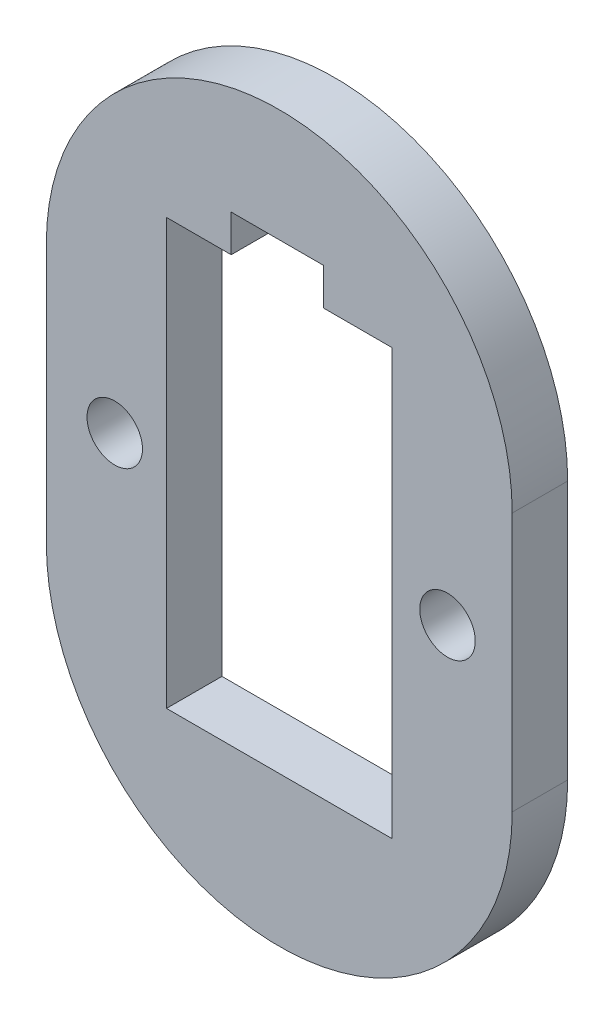
ISO-10303-21;
HEADER;
FILE_DESCRIPTION(('STEP AP214'),'2;1');
FILE_NAME('part.step','',(''),(''),'','','');
FILE_SCHEMA(('AUTOMOTIVE_DESIGN { 1 0 10303 214 1 1 1 1 }'));
ENDSEC;
DATA;
#1=APPLICATION_CONTEXT('core data for automotive mechanical design processes');
#2=APPLICATION_PROTOCOL_DEFINITION('international standard','automotive_design',2000,#1);
#3=PRODUCT_CONTEXT('',#1,'mechanical');
#4=PRODUCT('Part','Part','',(#3));
#5=PRODUCT_RELATED_PRODUCT_CATEGORY('part','',(#4));
#6=PRODUCT_DEFINITION_FORMATION('','',#4);
#7=PRODUCT_DEFINITION_CONTEXT('part definition',#1,'design');
#8=PRODUCT_DEFINITION('design','',#6,#7);
#9=PRODUCT_DEFINITION_SHAPE('','',#8);
#10=(LENGTH_UNIT() NAMED_UNIT(*) SI_UNIT(.MILLI.,.METRE.));
#11=(NAMED_UNIT(*) PLANE_ANGLE_UNIT() SI_UNIT($,.RADIAN.));
#12=(NAMED_UNIT(*) SI_UNIT($,.STERADIAN.) SOLID_ANGLE_UNIT());
#13=UNCERTAINTY_MEASURE_WITH_UNIT(LENGTH_MEASURE(1.E-05),#10,'distance_accuracy_value','');
#14=(GEOMETRIC_REPRESENTATION_CONTEXT(3) GLOBAL_UNCERTAINTY_ASSIGNED_CONTEXT((#13)) GLOBAL_UNIT_ASSIGNED_CONTEXT((#10,
#11,#12)) REPRESENTATION_CONTEXT('',''));
#15=CARTESIAN_POINT('',(0.,0.,0.));
#16=DIRECTION('',(0.,0.,1.));
#17=DIRECTION('',(1.,0.,0.));
#18=AXIS2_PLACEMENT_3D('',#15,#16,#17);
#19=CARTESIAN_POINT('',(13.4862400001923,25.2090395610512,3.));
#20=DIRECTION('',(0.,0.,1.));
#21=DIRECTION('',(1.,0.,0.));
#22=AXIS2_PLACEMENT_3D('',#19,#20,#21);
#23=PLANE('',#22);
#24=CARTESIAN_POINT('',(4.58628999666049,18.2090395573245,3.));
#25=DIRECTION('',(0.,0.,1.));
#26=DIRECTION('',(1.,0.,0.));
#27=AXIS2_PLACEMENT_3D('',#24,#25,#26);
#28=CIRCLE('',#27,1.5);
#29=CARTESIAN_POINT('',(6.08628999666049,18.2090395573245,3.));
#30=VERTEX_POINT('',#29);
#31=EDGE_CURVE('E194',#30,#30,#28,.T.);
#32=ORIENTED_EDGE('',*,*,#31,.F.);
#33=EDGE_LOOP('',(#32));
#34=FACE_BOUND('',#33,.T.);
#35=CARTESIAN_POINT('',(13.4862400001923,25.2090395610512,3.));
#36=DIRECTION('',(0.,0.,1.));
#37=DIRECTION('',(1.,0.,0.));
#38=AXIS2_PLACEMENT_3D('',#35,#36,#37);
#39=CIRCLE('',#38,12.6000000001984);
#40=CARTESIAN_POINT('',(26.0862400003905,25.2090418843459,3.));
#41=VERTEX_POINT('',#40);
#42=CARTESIAN_POINT('',(0.886239999993866,25.2090395610512,3.));
#43=VERTEX_POINT('',#42);
#44=EDGE_CURVE('E200',#41,#43,#39,.T.);
#45=ORIENTED_EDGE('',*,*,#44,.T.);
#46=DIRECTION('',(0.,-1.,0.));
#47=VECTOR('',#46,1.);
#48=CARTESIAN_POINT('',(0.886239999993866,25.2090395610512,3.));
#49=LINE('',#48,#47);
#50=CARTESIAN_POINT('',(0.886239999993911,11.208991882425,3.));
#51=VERTEX_POINT('',#50);
#52=EDGE_CURVE('E203',#43,#51,#49,.T.);
#53=ORIENTED_EDGE('',*,*,#52,.T.);
#54=CARTESIAN_POINT('',(13.4862399999939,11.208990720976,3.));
#55=DIRECTION('',(0.,0.,1.));
#56=DIRECTION('',(1.,0.,0.));
#57=AXIS2_PLACEMENT_3D('',#54,#55,#56);
#58=CIRCLE('',#57,12.6);
#59=CARTESIAN_POINT('',(26.0862399999939,11.2089895595271,3.));
#60=VERTEX_POINT('',#59);
#61=EDGE_CURVE('E206',#51,#60,#58,.T.);
#62=ORIENTED_EDGE('',*,*,#61,.T.);
#63=DIRECTION('',(2.83259459537294E-11,1.,0.));
#64=VECTOR('',#63,1.);
#65=CARTESIAN_POINT('',(26.0862399999939,11.2089895595271,3.));
#66=LINE('',#65,#64);
#67=EDGE_CURVE('E208',#60,#41,#66,.T.);
#68=ORIENTED_EDGE('',*,*,#67,.T.);
#69=EDGE_LOOP('',(#45,#53,#62,#68));
#70=FACE_BOUND('',#69,.T.);
#71=CARTESIAN_POINT('',(22.5862899966605,18.2090395573245,3.));
#72=DIRECTION('',(0.,0.,1.));
#73=DIRECTION('',(1.,0.,0.));
#74=AXIS2_PLACEMENT_3D('',#71,#72,#73);
#75=CIRCLE('',#74,1.5);
#76=CARTESIAN_POINT('',(24.0862899966605,18.2090395573245,3.));
#77=VERTEX_POINT('',#76);
#78=EDGE_CURVE('E188',#77,#77,#75,.T.);
#79=ORIENTED_EDGE('',*,*,#78,.F.);
#80=EDGE_LOOP('',(#79));
#81=FACE_BOUND('',#80,.T.);
#82=DIRECTION('',(0.,1.,0.));
#83=VECTOR('',#82,1.);
#84=CARTESIAN_POINT('',(19.5862388385449,6.70898956065782,3.));
#85=LINE('',#84,#83);
#86=CARTESIAN_POINT('',(19.5862388385449,6.70898956065782,3.));
#87=VERTEX_POINT('',#86);
#88=CARTESIAN_POINT('',(19.5862388385449,29.7089895606577,3.));
#89=VERTEX_POINT('',#88);
#90=EDGE_CURVE('E131',#87,#89,#85,.T.);
#91=ORIENTED_EDGE('',*,*,#90,.F.);
#92=DIRECTION('',(1.,0.,0.));
#93=VECTOR('',#92,1.);
#94=CARTESIAN_POINT('',(7.3862388385449,6.70898956065782,3.));
#95=LINE('',#94,#93);
#96=CARTESIAN_POINT('',(7.3862388385449,6.70898956065782,3.));
#97=VERTEX_POINT('',#96);
#98=EDGE_CURVE('E123',#97,#87,#95,.T.);
#99=ORIENTED_EDGE('',*,*,#98,.F.);
#100=DIRECTION('',(0.,-1.,0.));
#101=VECTOR('',#100,1.);
#102=CARTESIAN_POINT('',(7.3862388385449,29.7089895606578,3.));
#103=LINE('',#102,#101);
#104=CARTESIAN_POINT('',(7.3862388385449,29.7089895606578,3.));
#105=VERTEX_POINT('',#104);
#106=EDGE_CURVE('E156',#105,#97,#103,.T.);
#107=ORIENTED_EDGE('',*,*,#106,.F.);
#108=DIRECTION('',(-1.,0.,0.));
#109=VECTOR('',#108,1.);
#110=CARTESIAN_POINT('',(10.8862388385449,29.7089895606578,3.));
#111=LINE('',#110,#109);
#112=CARTESIAN_POINT('',(10.8862388385449,29.7089895606578,3.));
#113=VERTEX_POINT('',#112);
#114=EDGE_CURVE('E154',#113,#105,#111,.T.);
#115=ORIENTED_EDGE('',*,*,#114,.F.);
#116=DIRECTION('',(0.,-1.,0.));
#117=VECTOR('',#116,1.);
#118=CARTESIAN_POINT('',(10.8862388385449,31.7089895606578,3.));
#119=LINE('',#118,#117);
#120=CARTESIAN_POINT('',(10.8862388385449,31.7089895606578,3.));
#121=VERTEX_POINT('',#120);
#122=EDGE_CURVE('E152',#121,#113,#119,.T.);
#123=ORIENTED_EDGE('',*,*,#122,.F.);
#124=DIRECTION('',(-1.,0.,0.));
#125=VECTOR('',#124,1.);
#126=CARTESIAN_POINT('',(15.8862388385449,31.7089895606578,3.));
#127=LINE('',#126,#125);
#128=CARTESIAN_POINT('',(15.8862388385449,31.7089895606578,3.));
#129=VERTEX_POINT('',#128);
#130=EDGE_CURVE('E150',#129,#121,#127,.T.);
#131=ORIENTED_EDGE('',*,*,#130,.F.);
#132=DIRECTION('',(0.,1.,0.));
#133=VECTOR('',#132,1.);
#134=CARTESIAN_POINT('',(15.8862388385449,29.7089895606577,3.));
#135=LINE('',#134,#133);
#136=CARTESIAN_POINT('',(15.8862388385449,29.7089895606577,3.));
#137=VERTEX_POINT('',#136);
#138=EDGE_CURVE('E146',#137,#129,#135,.T.);
#139=ORIENTED_EDGE('',*,*,#138,.F.);
#140=DIRECTION('',(-1.,0.,0.));
#141=VECTOR('',#140,1.);
#142=CARTESIAN_POINT('',(19.5862388385449,29.7089895606577,3.));
#143=LINE('',#142,#141);
#144=EDGE_CURVE('E144',#89,#137,#143,.T.);
#145=ORIENTED_EDGE('',*,*,#144,.F.);
#146=EDGE_LOOP('',(#91,#99,#107,#115,#123,#131,#139,#145));
#147=FACE_BOUND('',#146,.T.);
#148=ADVANCED_FACE('F34',(#34,#70,#81,#147),#23,.T.);
#149=CARTESIAN_POINT('',(13.4862400001923,25.2090395610512,0.));
#150=DIRECTION('',(0.,0.,1.));
#151=DIRECTION('',(1.,0.,0.));
#152=AXIS2_PLACEMENT_3D('',#149,#150,#151);
#153=PLANE('',#152);
#154=CARTESIAN_POINT('',(22.5862899966605,18.2090395573245,0.));
#155=DIRECTION('',(0.,0.,1.));
#156=DIRECTION('',(1.,0.,0.));
#157=AXIS2_PLACEMENT_3D('',#154,#155,#156);
#158=CIRCLE('',#157,1.5);
#159=CARTESIAN_POINT('',(24.0862899966605,18.2090395573245,0.));
#160=VERTEX_POINT('',#159);
#161=EDGE_CURVE('E139',#160,#160,#158,.T.);
#162=ORIENTED_EDGE('',*,*,#161,.T.);
#163=EDGE_LOOP('',(#162));
#164=FACE_BOUND('',#163,.T.);
#165=CARTESIAN_POINT('',(4.58628999666049,18.2090395573245,0.));
#166=DIRECTION('',(0.,0.,1.));
#167=DIRECTION('',(1.,0.,0.));
#168=AXIS2_PLACEMENT_3D('',#165,#166,#167);
#169=CIRCLE('',#168,1.5);
#170=CARTESIAN_POINT('',(6.08628999666049,18.2090395573245,0.));
#171=VERTEX_POINT('',#170);
#172=EDGE_CURVE('E191',#171,#171,#169,.T.);
#173=ORIENTED_EDGE('',*,*,#172,.T.);
#174=EDGE_LOOP('',(#173));
#175=FACE_BOUND('',#174,.T.);
#176=CARTESIAN_POINT('',(13.4862400001923,25.2090395610512,0.));
#177=DIRECTION('',(0.,0.,1.));
#178=DIRECTION('',(1.,0.,0.));
#179=AXIS2_PLACEMENT_3D('',#176,#177,#178);
#180=CIRCLE('',#179,12.6000000001984);
#181=CARTESIAN_POINT('',(26.0862400003905,25.2090418843459,0.));
#182=VERTEX_POINT('',#181);
#183=CARTESIAN_POINT('',(0.886239999993866,25.2090395610512,0.));
#184=VERTEX_POINT('',#183);
#185=EDGE_CURVE('E197',#182,#184,#180,.T.);
#186=ORIENTED_EDGE('',*,*,#185,.F.);
#187=DIRECTION('',(2.83259459537294E-11,1.,0.));
#188=VECTOR('',#187,1.);
#189=CARTESIAN_POINT('',(26.0862399999939,11.2089895595271,0.));
#190=LINE('',#189,#188);
#191=CARTESIAN_POINT('',(26.0862399999939,11.2089895595271,0.));
#192=VERTEX_POINT('',#191);
#193=EDGE_CURVE('E204',#192,#182,#190,.T.);
#194=ORIENTED_EDGE('',*,*,#193,.F.);
#195=CARTESIAN_POINT('',(13.4862399999939,11.208990720976,0.));
#196=DIRECTION('',(0.,0.,1.));
#197=DIRECTION('',(1.,0.,0.));
#198=AXIS2_PLACEMENT_3D('',#195,#196,#197);
#199=CIRCLE('',#198,12.6);
#200=CARTESIAN_POINT('',(0.886239999993911,11.208991882425,0.));
#201=VERTEX_POINT('',#200);
#202=EDGE_CURVE('E215',#201,#192,#199,.T.);
#203=ORIENTED_EDGE('',*,*,#202,.F.);
#204=DIRECTION('',(0.,-1.,0.));
#205=VECTOR('',#204,1.);
#206=CARTESIAN_POINT('',(0.886239999993866,25.2090395610512,0.));
#207=LINE('',#206,#205);
#208=EDGE_CURVE('E213',#184,#201,#207,.T.);
#209=ORIENTED_EDGE('',*,*,#208,.F.);
#210=EDGE_LOOP('',(#186,#194,#203,#209));
#211=FACE_BOUND('',#210,.T.);
#212=DIRECTION('',(1.,0.,0.));
#213=VECTOR('',#212,1.);
#214=CARTESIAN_POINT('',(7.3862388385449,6.70898956065782,0.));
#215=LINE('',#214,#213);
#216=CARTESIAN_POINT('',(7.3862388385449,6.70898956065782,0.));
#217=VERTEX_POINT('',#216);
#218=CARTESIAN_POINT('',(19.5862388385449,6.70898956065782,0.));
#219=VERTEX_POINT('',#218);
#220=EDGE_CURVE('E57',#217,#219,#215,.T.);
#221=ORIENTED_EDGE('',*,*,#220,.T.);
#222=DIRECTION('',(0.,1.,0.));
#223=VECTOR('',#222,1.);
#224=CARTESIAN_POINT('',(19.5862388385449,6.70898956065782,0.));
#225=LINE('',#224,#223);
#226=CARTESIAN_POINT('',(19.5862388385449,29.7089895606577,0.));
#227=VERTEX_POINT('',#226);
#228=EDGE_CURVE('E138',#219,#227,#225,.T.);
#229=ORIENTED_EDGE('',*,*,#228,.T.);
#230=DIRECTION('',(-1.,0.,0.));
#231=VECTOR('',#230,1.);
#232=CARTESIAN_POINT('',(19.5862388385449,29.7089895606577,0.));
#233=LINE('',#232,#231);
#234=CARTESIAN_POINT('',(15.8862388385449,29.7089895606577,0.));
#235=VERTEX_POINT('',#234);
#236=EDGE_CURVE('E160',#227,#235,#233,.T.);
#237=ORIENTED_EDGE('',*,*,#236,.T.);
#238=DIRECTION('',(0.,1.,0.));
#239=VECTOR('',#238,1.);
#240=CARTESIAN_POINT('',(15.8862388385449,29.7089895606577,0.));
#241=LINE('',#240,#239);
#242=CARTESIAN_POINT('',(15.8862388385449,31.7089895606578,0.));
#243=VERTEX_POINT('',#242);
#244=EDGE_CURVE('E163',#235,#243,#241,.T.);
#245=ORIENTED_EDGE('',*,*,#244,.T.);
#246=DIRECTION('',(-1.,0.,0.));
#247=VECTOR('',#246,1.);
#248=CARTESIAN_POINT('',(15.8862388385449,31.7089895606578,0.));
#249=LINE('',#248,#247);
#250=CARTESIAN_POINT('',(10.8862388385449,31.7089895606578,0.));
#251=VERTEX_POINT('',#250);
#252=EDGE_CURVE('E166',#243,#251,#249,.T.);
#253=ORIENTED_EDGE('',*,*,#252,.T.);
#254=DIRECTION('',(0.,-1.,0.));
#255=VECTOR('',#254,1.);
#256=CARTESIAN_POINT('',(10.8862388385449,31.7089895606578,0.));
#257=LINE('',#256,#255);
#258=CARTESIAN_POINT('',(10.8862388385449,29.7089895606578,0.));
#259=VERTEX_POINT('',#258);
#260=EDGE_CURVE('E169',#251,#259,#257,.T.);
#261=ORIENTED_EDGE('',*,*,#260,.T.);
#262=DIRECTION('',(-1.,0.,0.));
#263=VECTOR('',#262,1.);
#264=CARTESIAN_POINT('',(10.8862388385449,29.7089895606578,0.));
#265=LINE('',#264,#263);
#266=CARTESIAN_POINT('',(7.3862388385449,29.7089895606578,0.));
#267=VERTEX_POINT('',#266);
#268=EDGE_CURVE('E172',#259,#267,#265,.T.);
#269=ORIENTED_EDGE('',*,*,#268,.T.);
#270=DIRECTION('',(0.,-1.,0.));
#271=VECTOR('',#270,1.);
#272=CARTESIAN_POINT('',(7.3862388385449,29.7089895606578,0.));
#273=LINE('',#272,#271);
#274=EDGE_CURVE('E132',#267,#217,#273,.T.);
#275=ORIENTED_EDGE('',*,*,#274,.T.);
#276=EDGE_LOOP('',(#221,#229,#237,#245,#253,#261,#269,#275));
#277=FACE_BOUND('',#276,.T.);
#278=ADVANCED_FACE('F233',(#164,#175,#211,#277),#153,.F.);
#279=CARTESIAN_POINT('',(13.4862400001923,25.2090395610512,3.));
#280=DIRECTION('',(0.,0.,-1.));
#281=DIRECTION('',(-1.,0.,0.));
#282=AXIS2_PLACEMENT_3D('',#279,#280,#281);
#283=CYLINDRICAL_SURFACE('',#282,12.6000000001984);
#284=ORIENTED_EDGE('',*,*,#185,.T.);
#285=DIRECTION('',(0.,0.,-1.));
#286=VECTOR('',#285,1.);
#287=CARTESIAN_POINT('',(0.886239999993866,25.2090395610512,3.));
#288=LINE('',#287,#286);
#289=EDGE_CURVE('E11',#43,#184,#288,.T.);
#290=ORIENTED_EDGE('',*,*,#289,.F.);
#291=ORIENTED_EDGE('',*,*,#44,.F.);
#292=DIRECTION('',(0.,0.,-1.));
#293=VECTOR('',#292,1.);
#294=CARTESIAN_POINT('',(26.0862400003905,25.2090418843459,3.));
#295=LINE('',#294,#293);
#296=EDGE_CURVE('E210',#41,#182,#295,.T.);
#297=ORIENTED_EDGE('',*,*,#296,.T.);
#298=EDGE_LOOP('',(#284,#290,#291,#297));
#299=FACE_BOUND('',#298,.T.);
#300=ADVANCED_FACE('F36',(#299),#283,.T.);
#301=CARTESIAN_POINT('',(0.886239999993866,25.2090395610512,3.));
#302=DIRECTION('',(1.,0.,0.));
#303=DIRECTION('',(0.,1.,0.));
#304=AXIS2_PLACEMENT_3D('',#301,#302,#303);
#305=PLANE('',#304);
#306=ORIENTED_EDGE('',*,*,#208,.T.);
#307=DIRECTION('',(0.,0.,-1.));
#308=VECTOR('',#307,1.);
#309=CARTESIAN_POINT('',(0.886239999993911,11.208991882425,3.));
#310=LINE('',#309,#308);
#311=EDGE_CURVE('E42',#51,#201,#310,.T.);
#312=ORIENTED_EDGE('',*,*,#311,.F.);
#313=ORIENTED_EDGE('',*,*,#52,.F.);
#314=ORIENTED_EDGE('',*,*,#289,.T.);
#315=EDGE_LOOP('',(#306,#312,#313,#314));
#316=FACE_BOUND('',#315,.T.);
#317=ADVANCED_FACE('F244',(#316),#305,.F.);
#318=CARTESIAN_POINT('',(13.4862399999939,11.208990720976,3.));
#319=DIRECTION('',(0.,0.,-1.));
#320=DIRECTION('',(-1.,0.,0.));
#321=AXIS2_PLACEMENT_3D('',#318,#319,#320);
#322=CYLINDRICAL_SURFACE('',#321,12.6);
#323=ORIENTED_EDGE('',*,*,#202,.T.);
#324=DIRECTION('',(0.,0.,-1.));
#325=VECTOR('',#324,1.);
#326=CARTESIAN_POINT('',(26.0862399999939,11.2089895595271,3.));
#327=LINE('',#326,#325);
#328=EDGE_CURVE('E220',#60,#192,#327,.T.);
#329=ORIENTED_EDGE('',*,*,#328,.F.);
#330=ORIENTED_EDGE('',*,*,#61,.F.);
#331=ORIENTED_EDGE('',*,*,#311,.T.);
#332=EDGE_LOOP('',(#323,#329,#330,#331));
#333=FACE_BOUND('',#332,.T.);
#334=ADVANCED_FACE('F227',(#333),#322,.T.);
#335=CARTESIAN_POINT('',(26.0862399999939,11.2089895595271,3.));
#336=DIRECTION('',(-1.,2.83259459537294E-11,0.));
#337=DIRECTION('',(-2.83259459537294E-11,-1.,0.));
#338=AXIS2_PLACEMENT_3D('',#335,#336,#337);
#339=PLANE('',#338);
#340=ORIENTED_EDGE('',*,*,#193,.T.);
#341=ORIENTED_EDGE('',*,*,#296,.F.);
#342=ORIENTED_EDGE('',*,*,#67,.F.);
#343=ORIENTED_EDGE('',*,*,#328,.T.);
#344=EDGE_LOOP('',(#340,#341,#342,#343));
#345=FACE_BOUND('',#344,.T.);
#346=ADVANCED_FACE('F237',(#345),#339,.F.);
#347=CARTESIAN_POINT('',(4.58628999666049,18.2090395573245,3.));
#348=DIRECTION('',(0.,0.,-1.));
#349=DIRECTION('',(-1.,0.,0.));
#350=AXIS2_PLACEMENT_3D('',#347,#348,#349);
#351=CYLINDRICAL_SURFACE('',#350,1.5);
#352=ORIENTED_EDGE('',*,*,#31,.T.);
#353=EDGE_LOOP('',(#352));
#354=FACE_BOUND('',#353,.T.);
#355=ORIENTED_EDGE('',*,*,#172,.F.);
#356=EDGE_LOOP('',(#355));
#357=FACE_BOUND('',#356,.T.);
#358=ADVANCED_FACE('F261',(#354,#357),#351,.F.);
#359=CARTESIAN_POINT('',(22.5862899966605,18.2090395573245,3.));
#360=DIRECTION('',(0.,0.,-1.));
#361=DIRECTION('',(-1.,0.,0.));
#362=AXIS2_PLACEMENT_3D('',#359,#360,#361);
#363=CYLINDRICAL_SURFACE('',#362,1.5);
#364=ORIENTED_EDGE('',*,*,#78,.T.);
#365=EDGE_LOOP('',(#364));
#366=FACE_BOUND('',#365,.T.);
#367=ORIENTED_EDGE('',*,*,#161,.F.);
#368=EDGE_LOOP('',(#367));
#369=FACE_BOUND('',#368,.T.);
#370=ADVANCED_FACE('F268',(#366,#369),#363,.F.);
#371=CARTESIAN_POINT('',(7.3862388385449,6.70898956065782,3.));
#372=DIRECTION('',(0.,1.,0.));
#373=DIRECTION('',(-1.,0.,0.));
#374=AXIS2_PLACEMENT_3D('',#371,#372,#373);
#375=PLANE('',#374);
#376=ORIENTED_EDGE('',*,*,#220,.F.);
#377=DIRECTION('',(0.,0.,-1.));
#378=VECTOR('',#377,1.);
#379=CARTESIAN_POINT('',(7.3862388385449,6.70898956065782,3.));
#380=LINE('',#379,#378);
#381=EDGE_CURVE('E127',#97,#217,#380,.T.);
#382=ORIENTED_EDGE('',*,*,#381,.F.);
#383=ORIENTED_EDGE('',*,*,#98,.T.);
#384=DIRECTION('',(0.,0.,-1.));
#385=VECTOR('',#384,1.);
#386=CARTESIAN_POINT('',(19.5862388385449,6.70898956065782,3.));
#387=LINE('',#386,#385);
#388=EDGE_CURVE('E126',#87,#219,#387,.T.);
#389=ORIENTED_EDGE('',*,*,#388,.T.);
#390=EDGE_LOOP('',(#376,#382,#383,#389));
#391=FACE_BOUND('',#390,.T.);
#392=ADVANCED_FACE('F125',(#391),#375,.T.);
#393=CARTESIAN_POINT('',(19.5862388385449,6.70898956065782,3.));
#394=DIRECTION('',(-1.,0.,0.));
#395=DIRECTION('',(0.,0.,1.));
#396=AXIS2_PLACEMENT_3D('',#393,#394,#395);
#397=PLANE('',#396);
#398=ORIENTED_EDGE('',*,*,#228,.F.);
#399=ORIENTED_EDGE('',*,*,#388,.F.);
#400=ORIENTED_EDGE('',*,*,#90,.T.);
#401=DIRECTION('',(0.,0.,-1.));
#402=VECTOR('',#401,1.);
#403=CARTESIAN_POINT('',(19.5862388385449,29.7089895606577,3.));
#404=LINE('',#403,#402);
#405=EDGE_CURVE('E140',#89,#227,#404,.T.);
#406=ORIENTED_EDGE('',*,*,#405,.T.);
#407=EDGE_LOOP('',(#398,#399,#400,#406));
#408=FACE_BOUND('',#407,.T.);
#409=ADVANCED_FACE('F135',(#408),#397,.T.);
#410=CARTESIAN_POINT('',(19.5862388385449,29.7089895606577,3.));
#411=DIRECTION('',(0.,-1.,0.));
#412=DIRECTION('',(0.,0.,-1.));
#413=AXIS2_PLACEMENT_3D('',#410,#411,#412);
#414=PLANE('',#413);
#415=ORIENTED_EDGE('',*,*,#236,.F.);
#416=ORIENTED_EDGE('',*,*,#405,.F.);
#417=ORIENTED_EDGE('',*,*,#144,.T.);
#418=DIRECTION('',(0.,0.,-1.));
#419=VECTOR('',#418,1.);
#420=CARTESIAN_POINT('',(15.8862388385449,29.7089895606577,3.));
#421=LINE('',#420,#419);
#422=EDGE_CURVE('E185',#137,#235,#421,.T.);
#423=ORIENTED_EDGE('',*,*,#422,.T.);
#424=EDGE_LOOP('',(#415,#416,#417,#423));
#425=FACE_BOUND('',#424,.T.);
#426=ADVANCED_FACE('F285',(#425),#414,.T.);
#427=CARTESIAN_POINT('',(15.8862388385449,29.7089895606577,3.));
#428=DIRECTION('',(-1.,0.,0.));
#429=DIRECTION('',(0.,-1.,0.));
#430=AXIS2_PLACEMENT_3D('',#427,#428,#429);
#431=PLANE('',#430);
#432=ORIENTED_EDGE('',*,*,#244,.F.);
#433=ORIENTED_EDGE('',*,*,#422,.F.);
#434=ORIENTED_EDGE('',*,*,#138,.T.);
#435=DIRECTION('',(0.,0.,-1.));
#436=VECTOR('',#435,1.);
#437=CARTESIAN_POINT('',(15.8862388385449,31.7089895606578,3.));
#438=LINE('',#437,#436);
#439=EDGE_CURVE('E183',#129,#243,#438,.T.);
#440=ORIENTED_EDGE('',*,*,#439,.T.);
#441=EDGE_LOOP('',(#432,#433,#434,#440));
#442=FACE_BOUND('',#441,.T.);
#443=ADVANCED_FACE('F288',(#442),#431,.T.);
#444=CARTESIAN_POINT('',(15.8862388385449,31.7089895606578,3.));
#445=DIRECTION('',(0.,-1.,0.));
#446=DIRECTION('',(1.,0.,0.));
#447=AXIS2_PLACEMENT_3D('',#444,#445,#446);
#448=PLANE('',#447);
#449=ORIENTED_EDGE('',*,*,#252,.F.);
#450=ORIENTED_EDGE('',*,*,#439,.F.);
#451=ORIENTED_EDGE('',*,*,#130,.T.);
#452=DIRECTION('',(0.,0.,-1.));
#453=VECTOR('',#452,1.);
#454=CARTESIAN_POINT('',(10.8862388385449,31.7089895606578,3.));
#455=LINE('',#454,#453);
#456=EDGE_CURVE('E181',#121,#251,#455,.T.);
#457=ORIENTED_EDGE('',*,*,#456,.T.);
#458=EDGE_LOOP('',(#449,#450,#451,#457));
#459=FACE_BOUND('',#458,.T.);
#460=ADVANCED_FACE('F292',(#459),#448,.T.);
#461=CARTESIAN_POINT('',(10.8862388385449,31.7089895606578,3.));
#462=DIRECTION('',(1.,0.,0.));
#463=DIRECTION('',(0.,0.,-1.));
#464=AXIS2_PLACEMENT_3D('',#461,#462,#463);
#465=PLANE('',#464);
#466=ORIENTED_EDGE('',*,*,#260,.F.);
#467=ORIENTED_EDGE('',*,*,#456,.F.);
#468=ORIENTED_EDGE('',*,*,#122,.T.);
#469=DIRECTION('',(0.,0.,-1.));
#470=VECTOR('',#469,1.);
#471=CARTESIAN_POINT('',(10.8862388385449,29.7089895606578,3.));
#472=LINE('',#471,#470);
#473=EDGE_CURVE('E179',#113,#259,#472,.T.);
#474=ORIENTED_EDGE('',*,*,#473,.T.);
#475=EDGE_LOOP('',(#466,#467,#468,#474));
#476=FACE_BOUND('',#475,.T.);
#477=ADVANCED_FACE('F296',(#476),#465,.T.);
#478=CARTESIAN_POINT('',(10.8862388385449,29.7089895606578,3.));
#479=DIRECTION('',(0.,-1.,0.));
#480=DIRECTION('',(0.,0.,-1.));
#481=AXIS2_PLACEMENT_3D('',#478,#479,#480);
#482=PLANE('',#481);
#483=ORIENTED_EDGE('',*,*,#268,.F.);
#484=ORIENTED_EDGE('',*,*,#473,.F.);
#485=ORIENTED_EDGE('',*,*,#114,.T.);
#486=DIRECTION('',(0.,0.,-1.));
#487=VECTOR('',#486,1.);
#488=CARTESIAN_POINT('',(7.3862388385449,29.7089895606578,3.));
#489=LINE('',#488,#487);
#490=EDGE_CURVE('E49',#105,#267,#489,.T.);
#491=ORIENTED_EDGE('',*,*,#490,.T.);
#492=EDGE_LOOP('',(#483,#484,#485,#491));
#493=FACE_BOUND('',#492,.T.);
#494=ADVANCED_FACE('F300',(#493),#482,.T.);
#495=CARTESIAN_POINT('',(7.3862388385449,29.7089895606578,3.));
#496=DIRECTION('',(1.,0.,0.));
#497=DIRECTION('',(0.,1.,0.));
#498=AXIS2_PLACEMENT_3D('',#495,#496,#497);
#499=PLANE('',#498);
#500=ORIENTED_EDGE('',*,*,#274,.F.);
#501=ORIENTED_EDGE('',*,*,#490,.F.);
#502=ORIENTED_EDGE('',*,*,#106,.T.);
#503=ORIENTED_EDGE('',*,*,#381,.T.);
#504=EDGE_LOOP('',(#500,#501,#502,#503));
#505=FACE_BOUND('',#504,.T.);
#506=ADVANCED_FACE('F304',(#505),#499,.T.);
#507=CLOSED_SHELL('',(#148,#278,#300,#317,#334,#346,#358,#370,#392,#409,#426,#443,#460,#477,
#494,#506));
#508=MANIFOLD_SOLID_BREP('B2',#507);
#509=ADVANCED_BREP_SHAPE_REPRESENTATION('',(#18,#508),#14);
#510=SHAPE_DEFINITION_REPRESENTATION(#9,#509);
ENDSEC;
END-ISO-10303-21;
